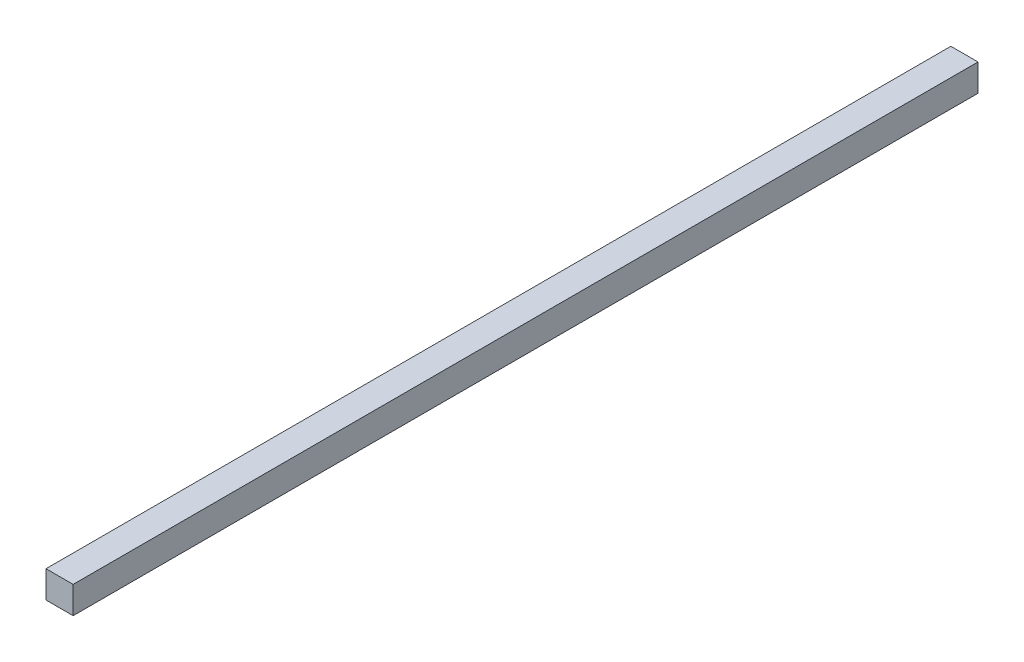
ISO-10303-21;
HEADER;
FILE_DESCRIPTION(('STEP AP214'),'2;1');
FILE_NAME('part.step','',(''),(''),'','','');
FILE_SCHEMA(('AUTOMOTIVE_DESIGN { 1 0 10303 214 1 1 1 1 }'));
ENDSEC;
DATA;
#1=APPLICATION_CONTEXT('core data for automotive mechanical design processes');
#2=APPLICATION_PROTOCOL_DEFINITION('international standard','automotive_design',2000,#1);
#3=PRODUCT_CONTEXT('',#1,'mechanical');
#4=PRODUCT('Part','Part','',(#3));
#5=PRODUCT_RELATED_PRODUCT_CATEGORY('part','',(#4));
#6=PRODUCT_DEFINITION_FORMATION('','',#4);
#7=PRODUCT_DEFINITION_CONTEXT('part definition',#1,'design');
#8=PRODUCT_DEFINITION('design','',#6,#7);
#9=PRODUCT_DEFINITION_SHAPE('','',#8);
#10=(LENGTH_UNIT() NAMED_UNIT(*) SI_UNIT(.MILLI.,.METRE.));
#11=(NAMED_UNIT(*) PLANE_ANGLE_UNIT() SI_UNIT($,.RADIAN.));
#12=(NAMED_UNIT(*) SI_UNIT($,.STERADIAN.) SOLID_ANGLE_UNIT());
#13=UNCERTAINTY_MEASURE_WITH_UNIT(LENGTH_MEASURE(1.E-05),#10,'distance_accuracy_value','');
#14=(GEOMETRIC_REPRESENTATION_CONTEXT(3) GLOBAL_UNCERTAINTY_ASSIGNED_CONTEXT((#13)) GLOBAL_UNIT_ASSIGNED_CONTEXT((#10,
#11,#12)) REPRESENTATION_CONTEXT('',''));
#15=CARTESIAN_POINT('',(0.,0.,0.));
#16=DIRECTION('',(0.,0.,1.));
#17=DIRECTION('',(1.,0.,0.));
#18=AXIS2_PLACEMENT_3D('',#15,#16,#17);
#19=CARTESIAN_POINT('',(0.,0.,100.));
#20=DIRECTION('',(1.,0.,0.));
#21=DIRECTION('',(0.,0.,-1.));
#22=AXIS2_PLACEMENT_3D('',#19,#20,#21);
#23=PLANE('',#22);
#24=DIRECTION('',(0.,-1.,0.));
#25=VECTOR('',#24,1.);
#26=CARTESIAN_POINT('',(0.,0.,0.));
#27=LINE('',#26,#25);
#28=CARTESIAN_POINT('',(0.,3.,0.));
#29=VERTEX_POINT('',#28);
#30=CARTESIAN_POINT('',(0.,0.,0.));
#31=VERTEX_POINT('',#30);
#32=EDGE_CURVE('E107',#29,#31,#27,.T.);
#33=ORIENTED_EDGE('',*,*,#32,.T.);
#34=DIRECTION('',(0.,0.,-1.));
#35=VECTOR('',#34,1.);
#36=CARTESIAN_POINT('',(0.,0.,100.));
#37=LINE('',#36,#35);
#38=CARTESIAN_POINT('',(0.,0.,100.));
#39=VERTEX_POINT('',#38);
#40=EDGE_CURVE('E11',#39,#31,#37,.T.);
#41=ORIENTED_EDGE('',*,*,#40,.F.);
#42=DIRECTION('',(0.,-1.,0.));
#43=VECTOR('',#42,1.);
#44=CARTESIAN_POINT('',(0.,0.,100.));
#45=LINE('',#44,#43);
#46=CARTESIAN_POINT('',(0.,3.,100.));
#47=VERTEX_POINT('',#46);
#48=EDGE_CURVE('E91',#47,#39,#45,.T.);
#49=ORIENTED_EDGE('',*,*,#48,.F.);
#50=DIRECTION('',(0.,0.,-1.));
#51=VECTOR('',#50,1.);
#52=CARTESIAN_POINT('',(0.,3.,100.));
#53=LINE('',#52,#51);
#54=EDGE_CURVE('E103',#47,#29,#53,.T.);
#55=ORIENTED_EDGE('',*,*,#54,.T.);
#56=EDGE_LOOP('',(#33,#41,#49,#55));
#57=FACE_BOUND('',#56,.T.);
#58=ADVANCED_FACE('F39',(#57),#23,.F.);
#59=CARTESIAN_POINT('',(0.,0.,100.));
#60=DIRECTION('',(0.,1.,0.));
#61=DIRECTION('',(0.,0.,1.));
#62=AXIS2_PLACEMENT_3D('',#59,#60,#61);
#63=PLANE('',#62);
#64=DIRECTION('',(1.,0.,0.));
#65=VECTOR('',#64,1.);
#66=CARTESIAN_POINT('',(0.,0.,0.));
#67=LINE('',#66,#65);
#68=CARTESIAN_POINT('',(3.,0.,0.));
#69=VERTEX_POINT('',#68);
#70=EDGE_CURVE('E96',#31,#69,#67,.T.);
#71=ORIENTED_EDGE('',*,*,#70,.T.);
#72=DIRECTION('',(0.,0.,-1.));
#73=VECTOR('',#72,1.);
#74=CARTESIAN_POINT('',(3.,0.,100.));
#75=LINE('',#74,#73);
#76=CARTESIAN_POINT('',(3.,0.,100.));
#77=VERTEX_POINT('',#76);
#78=EDGE_CURVE('E48',#77,#69,#75,.T.);
#79=ORIENTED_EDGE('',*,*,#78,.F.);
#80=DIRECTION('',(1.,0.,0.));
#81=VECTOR('',#80,1.);
#82=CARTESIAN_POINT('',(0.,0.,100.));
#83=LINE('',#82,#81);
#84=EDGE_CURVE('E86',#39,#77,#83,.T.);
#85=ORIENTED_EDGE('',*,*,#84,.F.);
#86=ORIENTED_EDGE('',*,*,#40,.T.);
#87=EDGE_LOOP('',(#71,#79,#85,#86));
#88=FACE_BOUND('',#87,.T.);
#89=ADVANCED_FACE('F95',(#88),#63,.F.);
#90=CARTESIAN_POINT('',(3.,0.,100.));
#91=DIRECTION('',(-1.,0.,0.));
#92=DIRECTION('',(0.,0.,1.));
#93=AXIS2_PLACEMENT_3D('',#90,#91,#92);
#94=PLANE('',#93);
#95=DIRECTION('',(0.,1.,0.));
#96=VECTOR('',#95,1.);
#97=CARTESIAN_POINT('',(3.,0.,0.));
#98=LINE('',#97,#96);
#99=CARTESIAN_POINT('',(3.,3.,0.));
#100=VERTEX_POINT('',#99);
#101=EDGE_CURVE('E73',#69,#100,#98,.T.);
#102=ORIENTED_EDGE('',*,*,#101,.T.);
#103=DIRECTION('',(0.,0.,-1.));
#104=VECTOR('',#103,1.);
#105=CARTESIAN_POINT('',(3.,3.,100.));
#106=LINE('',#105,#104);
#107=CARTESIAN_POINT('',(3.,3.,100.));
#108=VERTEX_POINT('',#107);
#109=EDGE_CURVE('E98',#108,#100,#106,.T.);
#110=ORIENTED_EDGE('',*,*,#109,.F.);
#111=DIRECTION('',(0.,1.,0.));
#112=VECTOR('',#111,1.);
#113=CARTESIAN_POINT('',(3.,0.,100.));
#114=LINE('',#113,#112);
#115=EDGE_CURVE('E89',#77,#108,#114,.T.);
#116=ORIENTED_EDGE('',*,*,#115,.F.);
#117=ORIENTED_EDGE('',*,*,#78,.T.);
#118=EDGE_LOOP('',(#102,#110,#116,#117));
#119=FACE_BOUND('',#118,.T.);
#120=ADVANCED_FACE('F99',(#119),#94,.F.);
#121=CARTESIAN_POINT('',(0.,3.,100.));
#122=DIRECTION('',(0.,-1.,0.));
#123=DIRECTION('',(0.,0.,-1.));
#124=AXIS2_PLACEMENT_3D('',#121,#122,#123);
#125=PLANE('',#124);
#126=DIRECTION('',(-1.,0.,0.));
#127=VECTOR('',#126,1.);
#128=CARTESIAN_POINT('',(0.,3.,0.));
#129=LINE('',#128,#127);
#130=EDGE_CURVE('E79',#100,#29,#129,.T.);
#131=ORIENTED_EDGE('',*,*,#130,.T.);
#132=ORIENTED_EDGE('',*,*,#54,.F.);
#133=DIRECTION('',(-1.,0.,0.));
#134=VECTOR('',#133,1.);
#135=CARTESIAN_POINT('',(0.,3.,100.));
#136=LINE('',#135,#134);
#137=EDGE_CURVE('E56',#108,#47,#136,.T.);
#138=ORIENTED_EDGE('',*,*,#137,.F.);
#139=ORIENTED_EDGE('',*,*,#109,.T.);
#140=EDGE_LOOP('',(#131,#132,#138,#139));
#141=FACE_BOUND('',#140,.T.);
#142=ADVANCED_FACE('F120',(#141),#125,.F.);
#143=CARTESIAN_POINT('',(0.,0.,100.));
#144=DIRECTION('',(0.,0.,-1.));
#145=DIRECTION('',(-1.,0.,0.));
#146=AXIS2_PLACEMENT_3D('',#143,#144,#145);
#147=PLANE('',#146);
#148=ORIENTED_EDGE('',*,*,#48,.T.);
#149=ORIENTED_EDGE('',*,*,#84,.T.);
#150=ORIENTED_EDGE('',*,*,#115,.T.);
#151=ORIENTED_EDGE('',*,*,#137,.T.);
#152=EDGE_LOOP('',(#148,#149,#150,#151));
#153=FACE_BOUND('',#152,.T.);
#154=ADVANCED_FACE('F87',(#153),#147,.F.);
#155=CARTESIAN_POINT('',(0.,0.,0.));
#156=DIRECTION('',(0.,0.,-1.));
#157=DIRECTION('',(-1.,0.,0.));
#158=AXIS2_PLACEMENT_3D('',#155,#156,#157);
#159=PLANE('',#158);
#160=ORIENTED_EDGE('',*,*,#32,.F.);
#161=ORIENTED_EDGE('',*,*,#130,.F.);
#162=ORIENTED_EDGE('',*,*,#101,.F.);
#163=ORIENTED_EDGE('',*,*,#70,.F.);
#164=EDGE_LOOP('',(#160,#161,#162,#163));
#165=FACE_BOUND('',#164,.T.);
#166=ADVANCED_FACE('F123',(#165),#159,.T.);
#167=CLOSED_SHELL('',(#58,#89,#120,#142,#154,#166));
#168=MANIFOLD_SOLID_BREP('B2',#167);
#169=ADVANCED_BREP_SHAPE_REPRESENTATION('',(#18,#168),#14);
#170=SHAPE_DEFINITION_REPRESENTATION(#9,#169);
ENDSEC;
END-ISO-10303-21;
